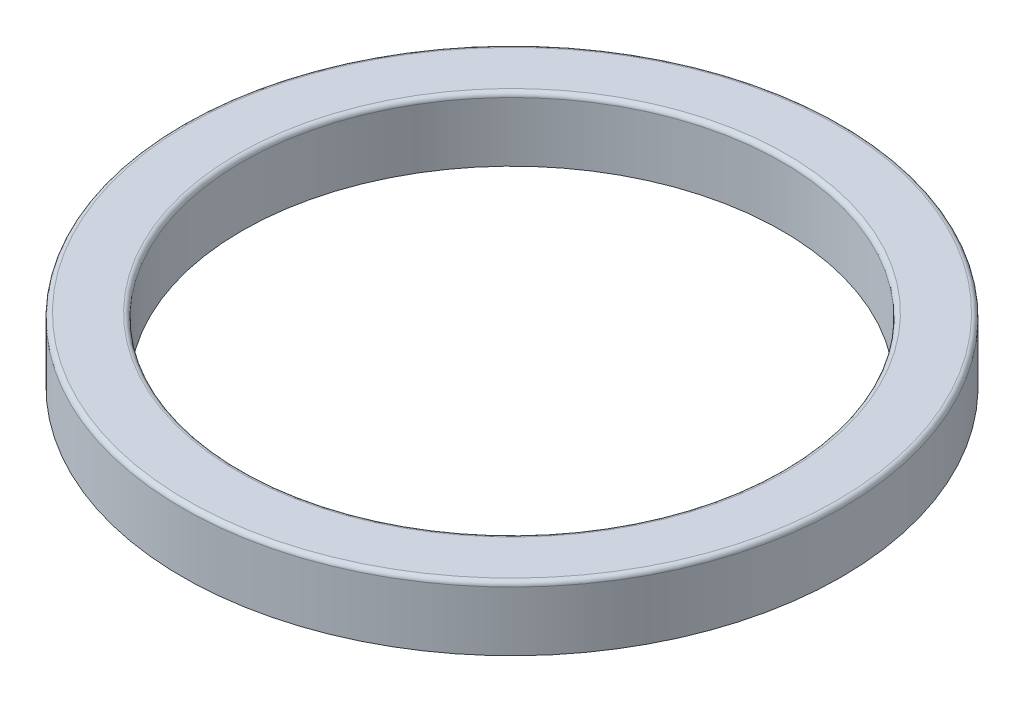
ISO-10303-21;
HEADER;
FILE_DESCRIPTION(('STEP AP214'),'2;1');
FILE_NAME('part.step','',(''),(''),'','','');
FILE_SCHEMA(('AUTOMOTIVE_DESIGN { 1 0 10303 214 1 1 1 1 }'));
ENDSEC;
DATA;
#1=APPLICATION_CONTEXT('core data for automotive mechanical design processes');
#2=APPLICATION_PROTOCOL_DEFINITION('international standard','automotive_design',2000,#1);
#3=PRODUCT_CONTEXT('',#1,'mechanical');
#4=PRODUCT('Part','Part','',(#3));
#5=PRODUCT_RELATED_PRODUCT_CATEGORY('part','',(#4));
#6=PRODUCT_DEFINITION_FORMATION('','',#4);
#7=PRODUCT_DEFINITION_CONTEXT('part definition',#1,'design');
#8=PRODUCT_DEFINITION('design','',#6,#7);
#9=PRODUCT_DEFINITION_SHAPE('','',#8);
#10=(LENGTH_UNIT() NAMED_UNIT(*) SI_UNIT(.MILLI.,.METRE.));
#11=(NAMED_UNIT(*) PLANE_ANGLE_UNIT() SI_UNIT($,.RADIAN.));
#12=(NAMED_UNIT(*) SI_UNIT($,.STERADIAN.) SOLID_ANGLE_UNIT());
#13=UNCERTAINTY_MEASURE_WITH_UNIT(LENGTH_MEASURE(1.E-05),#10,'distance_accuracy_value','');
#14=(GEOMETRIC_REPRESENTATION_CONTEXT(3) GLOBAL_UNCERTAINTY_ASSIGNED_CONTEXT((#13)) GLOBAL_UNIT_ASSIGNED_CONTEXT((#10,
#11,#12)) REPRESENTATION_CONTEXT('',''));
#15=CARTESIAN_POINT('',(0.,0.,0.));
#16=DIRECTION('',(0.,0.,1.));
#17=DIRECTION('',(1.,0.,0.));
#18=AXIS2_PLACEMENT_3D('',#15,#16,#17);
#19=CARTESIAN_POINT('',(0.,0.,0.));
#20=DIRECTION('',(0.,-1.,0.));
#21=DIRECTION('',(1.,0.,0.));
#22=AXIS2_PLACEMENT_3D('',#19,#20,#21);
#23=PLANE('',#22);
#24=CARTESIAN_POINT('',(0.,0.,0.));
#25=DIRECTION('',(0.,1.,0.));
#26=DIRECTION('',(1.,0.,0.));
#27=AXIS2_PLACEMENT_3D('',#24,#25,#26);
#28=CIRCLE('',#27,6.00482267939647);
#29=CARTESIAN_POINT('',(6.00482267939647,0.,0.));
#30=VERTEX_POINT('',#29);
#31=CARTESIAN_POINT('',(-6.00482267939647,0.,0.));
#32=VERTEX_POINT('',#31);
#33=EDGE_CURVE('E77',#30,#32,#28,.T.);
#34=ORIENTED_EDGE('',*,*,#33,.F.);
#35=CARTESIAN_POINT('',(0.,0.,0.));
#36=DIRECTION('',(0.,1.,0.));
#37=DIRECTION('',(-1.,0.,0.));
#38=AXIS2_PLACEMENT_3D('',#35,#36,#37);
#39=CIRCLE('',#38,6.00482267939647);
#40=EDGE_CURVE('E35',#32,#30,#39,.T.);
#41=ORIENTED_EDGE('',*,*,#40,.F.);
#42=EDGE_LOOP('',(#34,#41));
#43=FACE_BOUND('',#42,.T.);
#44=CARTESIAN_POINT('',(0.,0.,0.));
#45=DIRECTION('',(0.,-1.,0.));
#46=DIRECTION('',(1.,0.,0.));
#47=AXIS2_PLACEMENT_3D('',#44,#45,#46);
#48=CIRCLE('',#47,7.10482267939647);
#49=CARTESIAN_POINT('',(7.10482267939647,0.,0.));
#50=VERTEX_POINT('',#49);
#51=CARTESIAN_POINT('',(-7.10482267939647,0.,0.));
#52=VERTEX_POINT('',#51);
#53=EDGE_CURVE('E44',#50,#52,#48,.T.);
#54=ORIENTED_EDGE('',*,*,#53,.F.);
#55=CARTESIAN_POINT('',(0.,0.,0.));
#56=DIRECTION('',(0.,-1.,0.));
#57=DIRECTION('',(-1.,0.,0.));
#58=AXIS2_PLACEMENT_3D('',#55,#56,#57);
#59=CIRCLE('',#58,7.10482267939647);
#60=EDGE_CURVE('E46',#52,#50,#59,.T.);
#61=ORIENTED_EDGE('',*,*,#60,.F.);
#62=EDGE_LOOP('',(#54,#61));
#63=FACE_BOUND('',#62,.T.);
#64=ADVANCED_FACE('F16',(#43,#63),#23,.F.);
#65=CARTESIAN_POINT('',(0.,-0.0999999999999994,0.));
#66=DIRECTION('',(0.,-1.,0.));
#67=DIRECTION('',(1.,0.,0.));
#68=AXIS2_PLACEMENT_3D('',#65,#66,#67);
#69=TOROIDAL_SURFACE('',#68,7.10482267939647,0.1);
#70=ORIENTED_EDGE('',*,*,#53,.T.);
#71=ORIENTED_EDGE('',*,*,#60,.T.);
#72=EDGE_LOOP('',(#70,#71));
#73=FACE_BOUND('',#72,.T.);
#74=CARTESIAN_POINT('',(0.,-0.0999999999999994,0.));
#75=DIRECTION('',(0.,-1.,0.));
#76=DIRECTION('',(1.,0.,0.));
#77=AXIS2_PLACEMENT_3D('',#74,#75,#76);
#78=CIRCLE('',#77,7.20482267939647);
#79=CARTESIAN_POINT('',(7.20482267939647,-0.0999999999999985,0.));
#80=VERTEX_POINT('',#79);
#81=EDGE_CURVE('E117',#80,#80,#78,.T.);
#82=ORIENTED_EDGE('',*,*,#81,.F.);
#83=EDGE_LOOP('',(#82));
#84=FACE_BOUND('',#83,.T.);
#85=ADVANCED_FACE('F48',(#73,#84),#69,.T.);
#86=CARTESIAN_POINT('',(0.,-0.0999999999999994,0.));
#87=DIRECTION('',(0.,-1.,0.));
#88=DIRECTION('',(1.,0.,0.));
#89=AXIS2_PLACEMENT_3D('',#86,#87,#88);
#90=TOROIDAL_SURFACE('',#89,6.00482267939647,0.1);
#91=CARTESIAN_POINT('',(0.,-0.0999999999999994,0.));
#92=DIRECTION('',(0.,-1.,0.));
#93=DIRECTION('',(1.,0.,0.));
#94=AXIS2_PLACEMENT_3D('',#91,#92,#93);
#95=CIRCLE('',#94,5.90482267939647);
#96=CARTESIAN_POINT('',(5.90482267939647,-0.0999999999999987,0.));
#97=VERTEX_POINT('',#96);
#98=EDGE_CURVE('E115',#97,#97,#95,.T.);
#99=ORIENTED_EDGE('',*,*,#98,.T.);
#100=EDGE_LOOP('',(#99));
#101=FACE_BOUND('',#100,.T.);
#102=ORIENTED_EDGE('',*,*,#33,.T.);
#103=ORIENTED_EDGE('',*,*,#40,.T.);
#104=EDGE_LOOP('',(#102,#103));
#105=FACE_BOUND('',#104,.T.);
#106=ADVANCED_FACE('F98',(#101,#105),#90,.T.);
#107=CARTESIAN_POINT('',(0.,20.3783158953915,0.));
#108=DIRECTION('',(0.,-1.,0.));
#109=DIRECTION('',(1.,0.,0.));
#110=AXIS2_PLACEMENT_3D('',#107,#108,#109);
#111=CYLINDRICAL_SURFACE('',#110,7.20482267939647);
#112=ORIENTED_EDGE('',*,*,#81,.T.);
#113=EDGE_LOOP('',(#112));
#114=FACE_BOUND('',#113,.T.);
#115=CARTESIAN_POINT('',(0.,-1.4,0.));
#116=DIRECTION('',(0.,-1.,0.));
#117=DIRECTION('',(1.,0.,0.));
#118=AXIS2_PLACEMENT_3D('',#115,#116,#117);
#119=CIRCLE('',#118,7.20482267939647);
#120=CARTESIAN_POINT('',(7.20482267939647,-1.4,0.));
#121=VERTEX_POINT('',#120);
#122=EDGE_CURVE('E27',#121,#121,#119,.F.);
#123=ORIENTED_EDGE('',*,*,#122,.T.);
#124=EDGE_LOOP('',(#123));
#125=FACE_BOUND('',#124,.T.);
#126=ADVANCED_FACE('F108',(#114,#125),#111,.T.);
#127=CARTESIAN_POINT('',(0.,20.3783158953915,0.));
#128=DIRECTION('',(0.,-1.,0.));
#129=DIRECTION('',(1.,0.,0.));
#130=AXIS2_PLACEMENT_3D('',#127,#128,#129);
#131=CYLINDRICAL_SURFACE('',#130,5.90482267939647);
#132=CARTESIAN_POINT('',(0.,-1.4,0.));
#133=DIRECTION('',(0.,-1.,0.));
#134=DIRECTION('',(1.,0.,0.));
#135=AXIS2_PLACEMENT_3D('',#132,#133,#134);
#136=CIRCLE('',#135,5.90482267939647);
#137=CARTESIAN_POINT('',(5.90482267939647,-1.4,0.));
#138=VERTEX_POINT('',#137);
#139=EDGE_CURVE('E10',#138,#138,#136,.T.);
#140=ORIENTED_EDGE('',*,*,#139,.T.);
#141=EDGE_LOOP('',(#140));
#142=FACE_BOUND('',#141,.T.);
#143=ORIENTED_EDGE('',*,*,#98,.F.);
#144=EDGE_LOOP('',(#143));
#145=FACE_BOUND('',#144,.T.);
#146=ADVANCED_FACE('F129',(#142,#145),#131,.F.);
#147=CARTESIAN_POINT('',(0.,-1.4,0.));
#148=DIRECTION('',(0.,1.,0.));
#149=DIRECTION('',(-1.,0.,0.));
#150=AXIS2_PLACEMENT_3D('',#147,#148,#149);
#151=PLANE('',#150);
#152=ORIENTED_EDGE('',*,*,#139,.F.);
#153=EDGE_LOOP('',(#152));
#154=FACE_BOUND('',#153,.T.);
#155=ORIENTED_EDGE('',*,*,#122,.F.);
#156=EDGE_LOOP('',(#155));
#157=FACE_BOUND('',#156,.T.);
#158=ADVANCED_FACE('F127',(#154,#157),#151,.F.);
#159=CLOSED_SHELL('',(#64,#85,#106,#126,#146,#158));
#160=MANIFOLD_SOLID_BREP('B1',#159);
#161=ADVANCED_BREP_SHAPE_REPRESENTATION('',(#18,#160),#14);
#162=SHAPE_DEFINITION_REPRESENTATION(#9,#161);
ENDSEC;
END-ISO-10303-21;
